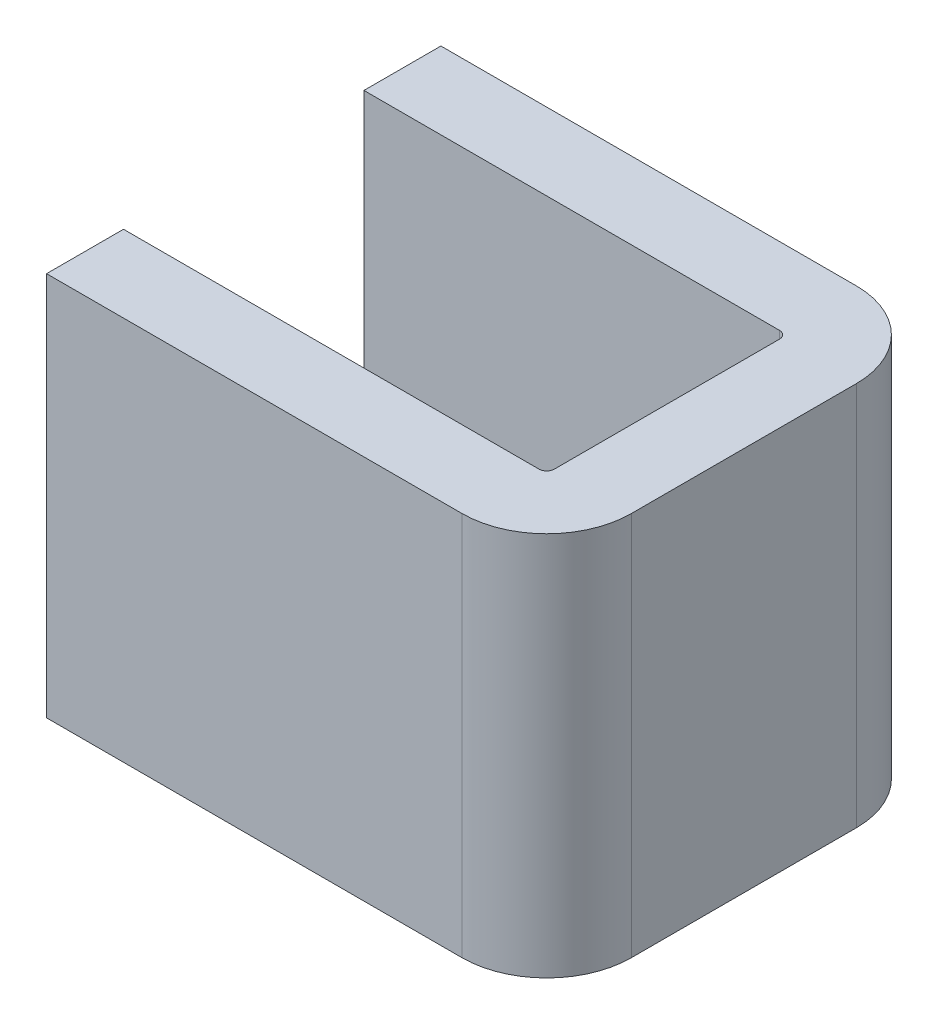
ISO-10303-21;
HEADER;
FILE_DESCRIPTION(('STEP AP214'),'2;1');
FILE_NAME('part.step','',(''),(''),'','','');
FILE_SCHEMA(('AUTOMOTIVE_DESIGN { 1 0 10303 214 1 1 1 1 }'));
ENDSEC;
DATA;
#1=APPLICATION_CONTEXT('core data for automotive mechanical design processes');
#2=APPLICATION_PROTOCOL_DEFINITION('international standard','automotive_design',2000,#1);
#3=PRODUCT_CONTEXT('',#1,'mechanical');
#4=PRODUCT('Part','Part','',(#3));
#5=PRODUCT_RELATED_PRODUCT_CATEGORY('part','',(#4));
#6=PRODUCT_DEFINITION_FORMATION('','',#4);
#7=PRODUCT_DEFINITION_CONTEXT('part definition',#1,'design');
#8=PRODUCT_DEFINITION('design','',#6,#7);
#9=PRODUCT_DEFINITION_SHAPE('','',#8);
#10=(LENGTH_UNIT() NAMED_UNIT(*) SI_UNIT(.MILLI.,.METRE.));
#11=(NAMED_UNIT(*) PLANE_ANGLE_UNIT() SI_UNIT($,.RADIAN.));
#12=(NAMED_UNIT(*) SI_UNIT($,.STERADIAN.) SOLID_ANGLE_UNIT());
#13=UNCERTAINTY_MEASURE_WITH_UNIT(LENGTH_MEASURE(1.E-05),#10,'distance_accuracy_value','');
#14=(GEOMETRIC_REPRESENTATION_CONTEXT(3) GLOBAL_UNCERTAINTY_ASSIGNED_CONTEXT((#13)) GLOBAL_UNIT_ASSIGNED_CONTEXT((#10,
#11,#12)) REPRESENTATION_CONTEXT('',''));
#15=CARTESIAN_POINT('',(0.,0.,0.));
#16=DIRECTION('',(0.,0.,1.));
#17=DIRECTION('',(1.,0.,0.));
#18=AXIS2_PLACEMENT_3D('',#15,#16,#17);
#19=CARTESIAN_POINT('',(1.08,0.5,0.));
#20=DIRECTION('',(0.,0.,1.));
#21=DIRECTION('',(1.,0.,0.));
#22=AXIS2_PLACEMENT_3D('',#19,#20,#21);
#23=PLANE('',#22);
#24=DIRECTION('',(0.,1.,0.));
#25=VECTOR('',#24,1.);
#26=CARTESIAN_POINT('',(0.,-0.5,0.));
#27=LINE('',#26,#25);
#28=CARTESIAN_POINT('',(0.,-0.5,0.));
#29=VERTEX_POINT('',#28);
#30=CARTESIAN_POINT('',(0.,0.5,0.));
#31=VERTEX_POINT('',#30);
#32=EDGE_CURVE('E96',#29,#31,#27,.T.);
#33=ORIENTED_EDGE('',*,*,#32,.T.);
#34=DIRECTION('',(1.,0.,0.));
#35=VECTOR('',#34,1.);
#36=CARTESIAN_POINT('',(1.08,0.5,0.));
#37=LINE('',#36,#35);
#38=CARTESIAN_POINT('',(1.08,0.5,0.));
#39=VERTEX_POINT('',#38);
#40=EDGE_CURVE('E187',#31,#39,#37,.T.);
#41=ORIENTED_EDGE('',*,*,#40,.T.);
#42=DIRECTION('',(0.,1.,0.));
#43=VECTOR('',#42,1.);
#44=CARTESIAN_POINT('',(1.08,0.5,0.));
#45=LINE('',#44,#43);
#46=CARTESIAN_POINT('',(1.08,-0.5,0.));
#47=VERTEX_POINT('',#46);
#48=EDGE_CURVE('E189',#47,#39,#45,.T.);
#49=ORIENTED_EDGE('',*,*,#48,.F.);
#50=DIRECTION('',(1.,0.,0.));
#51=VECTOR('',#50,1.);
#52=CARTESIAN_POINT('',(1.08,-0.5,0.));
#53=LINE('',#52,#51);
#54=EDGE_CURVE('E86',#47,#29,#53,.F.);
#55=ORIENTED_EDGE('',*,*,#54,.T.);
#56=EDGE_LOOP('',(#33,#41,#49,#55));
#57=FACE_BOUND('',#56,.T.);
#58=ADVANCED_FACE('F16',(#57),#23,.F.);
#59=CARTESIAN_POINT('',(0.,-0.5,0.2));
#60=DIRECTION('',(1.,0.,0.));
#61=DIRECTION('',(0.,0.,-1.));
#62=AXIS2_PLACEMENT_3D('',#59,#60,#61);
#63=PLANE('',#62);
#64=DIRECTION('',(0.,0.,-1.));
#65=VECTOR('',#64,1.);
#66=CARTESIAN_POINT('',(0.,0.5,0.2));
#67=LINE('',#66,#65);
#68=CARTESIAN_POINT('',(0.,0.5,0.2));
#69=VERTEX_POINT('',#68);
#70=EDGE_CURVE('E183',#69,#31,#67,.T.);
#71=ORIENTED_EDGE('',*,*,#70,.T.);
#72=ORIENTED_EDGE('',*,*,#32,.F.);
#73=DIRECTION('',(0.,0.,-1.));
#74=VECTOR('',#73,1.);
#75=CARTESIAN_POINT('',(0.,-0.5,0.2));
#76=LINE('',#75,#74);
#77=CARTESIAN_POINT('',(0.,-0.5,0.2));
#78=VERTEX_POINT('',#77);
#79=EDGE_CURVE('E191',#78,#29,#76,.T.);
#80=ORIENTED_EDGE('',*,*,#79,.F.);
#81=DIRECTION('',(0.,1.,0.));
#82=VECTOR('',#81,1.);
#83=CARTESIAN_POINT('',(0.,-0.5,0.2));
#84=LINE('',#83,#82);
#85=EDGE_CURVE('E185',#78,#69,#84,.T.);
#86=ORIENTED_EDGE('',*,*,#85,.T.);
#87=EDGE_LOOP('',(#71,#72,#80,#86));
#88=FACE_BOUND('',#87,.T.);
#89=ADVANCED_FACE('F174',(#88),#63,.F.);
#90=CARTESIAN_POINT('',(1.08,0.5,0.22));
#91=DIRECTION('',(0.,1.,0.));
#92=DIRECTION('',(0.,0.,1.));
#93=AXIS2_PLACEMENT_3D('',#90,#91,#92);
#94=CYLINDRICAL_SURFACE('',#93,0.22);
#95=CARTESIAN_POINT('',(1.08,0.5,0.22));
#96=DIRECTION('',(0.,1.,0.));
#97=DIRECTION('',(0.,0.,1.));
#98=AXIS2_PLACEMENT_3D('',#95,#96,#97);
#99=CIRCLE('',#98,0.22);
#100=CARTESIAN_POINT('',(1.3,0.5,0.22));
#101=VERTEX_POINT('',#100);
#102=EDGE_CURVE('E232',#101,#39,#99,.T.);
#103=ORIENTED_EDGE('',*,*,#102,.F.);
#104=DIRECTION('',(0.,1.,0.));
#105=VECTOR('',#104,1.);
#106=CARTESIAN_POINT('',(1.3,0.5,0.22));
#107=LINE('',#106,#105);
#108=CARTESIAN_POINT('',(1.3,-0.5,0.22));
#109=VERTEX_POINT('',#108);
#110=EDGE_CURVE('E234',#101,#109,#107,.F.);
#111=ORIENTED_EDGE('',*,*,#110,.T.);
#112=CARTESIAN_POINT('',(1.08,-0.5,0.22));
#113=DIRECTION('',(0.,1.,0.));
#114=DIRECTION('',(0.,0.,1.));
#115=AXIS2_PLACEMENT_3D('',#112,#113,#114);
#116=CIRCLE('',#115,0.22);
#117=EDGE_CURVE('E19',#47,#109,#116,.F.);
#118=ORIENTED_EDGE('',*,*,#117,.F.);
#119=ORIENTED_EDGE('',*,*,#48,.T.);
#120=EDGE_LOOP('',(#103,#111,#118,#119));
#121=FACE_BOUND('',#120,.T.);
#122=ADVANCED_FACE('F171',(#121),#94,.T.);
#123=CARTESIAN_POINT('',(1.08,-0.5,0.2));
#124=DIRECTION('',(0.,0.,-1.));
#125=DIRECTION('',(-1.,0.,0.));
#126=AXIS2_PLACEMENT_3D('',#123,#124,#125);
#127=PLANE('',#126);
#128=ORIENTED_EDGE('',*,*,#85,.F.);
#129=DIRECTION('',(-1.,0.,0.));
#130=VECTOR('',#129,1.);
#131=CARTESIAN_POINT('',(1.08,-0.5,0.2));
#132=LINE('',#131,#130);
#133=CARTESIAN_POINT('',(1.08,-0.5,0.2));
#134=VERTEX_POINT('',#133);
#135=EDGE_CURVE('E200',#134,#78,#132,.T.);
#136=ORIENTED_EDGE('',*,*,#135,.F.);
#137=DIRECTION('',(0.,1.,0.));
#138=VECTOR('',#137,1.);
#139=CARTESIAN_POINT('',(1.08,-0.5,0.2));
#140=LINE('',#139,#138);
#141=CARTESIAN_POINT('',(1.08,0.5,0.2));
#142=VERTEX_POINT('',#141);
#143=EDGE_CURVE('E228',#134,#142,#140,.T.);
#144=ORIENTED_EDGE('',*,*,#143,.T.);
#145=DIRECTION('',(-1.,0.,0.));
#146=VECTOR('',#145,1.);
#147=CARTESIAN_POINT('',(1.08,0.5,0.2));
#148=LINE('',#147,#146);
#149=EDGE_CURVE('E199',#69,#142,#148,.F.);
#150=ORIENTED_EDGE('',*,*,#149,.F.);
#151=EDGE_LOOP('',(#128,#136,#144,#150));
#152=FACE_BOUND('',#151,.T.);
#153=ADVANCED_FACE('F167',(#152),#127,.F.);
#154=CARTESIAN_POINT('',(1.3,0.5,0.805));
#155=DIRECTION('',(-1.,0.,0.));
#156=DIRECTION('',(0.,0.,1.));
#157=AXIS2_PLACEMENT_3D('',#154,#155,#156);
#158=PLANE('',#157);
#159=ORIENTED_EDGE('',*,*,#110,.F.);
#160=DIRECTION('',(0.,0.,-1.));
#161=VECTOR('',#160,1.);
#162=CARTESIAN_POINT('',(1.3,0.5,0.805));
#163=LINE('',#162,#161);
#164=CARTESIAN_POINT('',(1.3,0.5,0.805));
#165=VERTEX_POINT('',#164);
#166=EDGE_CURVE('E227',#101,#165,#163,.F.);
#167=ORIENTED_EDGE('',*,*,#166,.T.);
#168=DIRECTION('',(0.,1.,0.));
#169=VECTOR('',#168,1.);
#170=CARTESIAN_POINT('',(1.3,0.5,0.805));
#171=LINE('',#170,#169);
#172=CARTESIAN_POINT('',(1.3,-0.5,0.805));
#173=VERTEX_POINT('',#172);
#174=EDGE_CURVE('E224',#173,#165,#171,.T.);
#175=ORIENTED_EDGE('',*,*,#174,.F.);
#176=DIRECTION('',(0.,0.,1.));
#177=VECTOR('',#176,1.);
#178=CARTESIAN_POINT('',(1.3,-0.5,0.805));
#179=LINE('',#178,#177);
#180=EDGE_CURVE('E231',#173,#109,#179,.F.);
#181=ORIENTED_EDGE('',*,*,#180,.T.);
#182=EDGE_LOOP('',(#159,#167,#175,#181));
#183=FACE_BOUND('',#182,.T.);
#184=ADVANCED_FACE('F163',(#183),#158,.F.);
#185=CARTESIAN_POINT('',(1.08,-0.5,0.22));
#186=DIRECTION('',(0.,1.,0.));
#187=DIRECTION('',(0.,0.,1.));
#188=AXIS2_PLACEMENT_3D('',#185,#186,#187);
#189=CYLINDRICAL_SURFACE('',#188,0.02);
#190=ORIENTED_EDGE('',*,*,#143,.F.);
#191=CARTESIAN_POINT('',(1.08,-0.5,0.22));
#192=DIRECTION('',(0.,1.,0.));
#193=DIRECTION('',(0.,0.,1.));
#194=AXIS2_PLACEMENT_3D('',#191,#192,#193);
#195=CIRCLE('',#194,0.02);
#196=CARTESIAN_POINT('',(1.1,-0.5,0.22));
#197=VERTEX_POINT('',#196);
#198=EDGE_CURVE('E229',#197,#134,#195,.T.);
#199=ORIENTED_EDGE('',*,*,#198,.F.);
#200=DIRECTION('',(0.,1.,0.));
#201=VECTOR('',#200,1.);
#202=CARTESIAN_POINT('',(1.1,-0.5,0.22));
#203=LINE('',#202,#201);
#204=CARTESIAN_POINT('',(1.1,0.5,0.22));
#205=VERTEX_POINT('',#204);
#206=EDGE_CURVE('E256',#197,#205,#203,.T.);
#207=ORIENTED_EDGE('',*,*,#206,.T.);
#208=CARTESIAN_POINT('',(1.08,0.5,0.22));
#209=DIRECTION('',(0.,1.,0.));
#210=DIRECTION('',(0.,0.,1.));
#211=AXIS2_PLACEMENT_3D('',#208,#209,#210);
#212=CIRCLE('',#211,0.02);
#213=EDGE_CURVE('E225',#142,#205,#212,.F.);
#214=ORIENTED_EDGE('',*,*,#213,.F.);
#215=EDGE_LOOP('',(#190,#199,#207,#214));
#216=FACE_BOUND('',#215,.T.);
#217=ADVANCED_FACE('F159',(#216),#189,.F.);
#218=CARTESIAN_POINT('',(1.08,0.5,0.805));
#219=DIRECTION('',(0.,1.,0.));
#220=DIRECTION('',(0.,0.,1.));
#221=AXIS2_PLACEMENT_3D('',#218,#219,#220);
#222=CYLINDRICAL_SURFACE('',#221,0.22);
#223=CARTESIAN_POINT('',(1.08,0.5,0.805));
#224=DIRECTION('',(0.,1.,0.));
#225=DIRECTION('',(0.,0.,1.));
#226=AXIS2_PLACEMENT_3D('',#223,#224,#225);
#227=CIRCLE('',#226,0.22);
#228=CARTESIAN_POINT('',(1.08,0.5,1.025));
#229=VERTEX_POINT('',#228);
#230=EDGE_CURVE('E217',#229,#165,#227,.T.);
#231=ORIENTED_EDGE('',*,*,#230,.F.);
#232=DIRECTION('',(0.,1.,0.));
#233=VECTOR('',#232,1.);
#234=CARTESIAN_POINT('',(1.08,0.5,1.025));
#235=LINE('',#234,#233);
#236=CARTESIAN_POINT('',(1.08,-0.5,1.025));
#237=VERTEX_POINT('',#236);
#238=EDGE_CURVE('E219',#229,#237,#235,.F.);
#239=ORIENTED_EDGE('',*,*,#238,.T.);
#240=CARTESIAN_POINT('',(1.08,-0.5,0.805));
#241=DIRECTION('',(0.,1.,0.));
#242=DIRECTION('',(0.,0.,1.));
#243=AXIS2_PLACEMENT_3D('',#240,#241,#242);
#244=CIRCLE('',#243,0.22);
#245=EDGE_CURVE('E221',#173,#237,#244,.F.);
#246=ORIENTED_EDGE('',*,*,#245,.F.);
#247=ORIENTED_EDGE('',*,*,#174,.T.);
#248=EDGE_LOOP('',(#231,#239,#246,#247));
#249=FACE_BOUND('',#248,.T.);
#250=ADVANCED_FACE('F155',(#249),#222,.T.);
#251=CARTESIAN_POINT('',(1.1,-0.5,0.805));
#252=DIRECTION('',(1.,0.,0.));
#253=DIRECTION('',(0.,0.,-1.));
#254=AXIS2_PLACEMENT_3D('',#251,#252,#253);
#255=PLANE('',#254);
#256=ORIENTED_EDGE('',*,*,#206,.F.);
#257=DIRECTION('',(0.,0.,-1.));
#258=VECTOR('',#257,1.);
#259=CARTESIAN_POINT('',(1.1,-0.5,0.805));
#260=LINE('',#259,#258);
#261=CARTESIAN_POINT('',(1.1,-0.5,0.805));
#262=VERTEX_POINT('',#261);
#263=EDGE_CURVE('E223',#262,#197,#260,.T.);
#264=ORIENTED_EDGE('',*,*,#263,.F.);
#265=DIRECTION('',(0.,1.,0.));
#266=VECTOR('',#265,1.);
#267=CARTESIAN_POINT('',(1.1,-0.5,0.805));
#268=LINE('',#267,#266);
#269=CARTESIAN_POINT('',(1.1,0.5,0.805));
#270=VERTEX_POINT('',#269);
#271=EDGE_CURVE('E212',#262,#270,#268,.T.);
#272=ORIENTED_EDGE('',*,*,#271,.T.);
#273=DIRECTION('',(0.,0.,-1.));
#274=VECTOR('',#273,1.);
#275=CARTESIAN_POINT('',(1.1,0.5,0.805));
#276=LINE('',#275,#274);
#277=EDGE_CURVE('E220',#205,#270,#276,.F.);
#278=ORIENTED_EDGE('',*,*,#277,.F.);
#279=EDGE_LOOP('',(#256,#264,#272,#278));
#280=FACE_BOUND('',#279,.T.);
#281=ADVANCED_FACE('F151',(#280),#255,.F.);
#282=CARTESIAN_POINT('',(0.,0.5,1.025));
#283=DIRECTION('',(0.,0.,-1.));
#284=DIRECTION('',(-1.,0.,0.));
#285=AXIS2_PLACEMENT_3D('',#282,#283,#284);
#286=PLANE('',#285);
#287=ORIENTED_EDGE('',*,*,#238,.F.);
#288=DIRECTION('',(1.,0.,0.));
#289=VECTOR('',#288,1.);
#290=CARTESIAN_POINT('',(0.,0.5,1.025));
#291=LINE('',#290,#289);
#292=CARTESIAN_POINT('',(0.,0.5,1.025));
#293=VERTEX_POINT('',#292);
#294=EDGE_CURVE('E120',#229,#293,#291,.F.);
#295=ORIENTED_EDGE('',*,*,#294,.T.);
#296=DIRECTION('',(0.,1.,0.));
#297=VECTOR('',#296,1.);
#298=CARTESIAN_POINT('',(0.,-0.5,1.025));
#299=LINE('',#298,#297);
#300=CARTESIAN_POINT('',(0.,-0.5,1.025));
#301=VERTEX_POINT('',#300);
#302=EDGE_CURVE('E125',#301,#293,#299,.T.);
#303=ORIENTED_EDGE('',*,*,#302,.F.);
#304=DIRECTION('',(1.,0.,0.));
#305=VECTOR('',#304,1.);
#306=CARTESIAN_POINT('',(0.,-0.5,1.025));
#307=LINE('',#306,#305);
#308=EDGE_CURVE('E216',#301,#237,#307,.T.);
#309=ORIENTED_EDGE('',*,*,#308,.T.);
#310=EDGE_LOOP('',(#287,#295,#303,#309));
#311=FACE_BOUND('',#310,.T.);
#312=ADVANCED_FACE('F148',(#311),#286,.F.);
#313=CARTESIAN_POINT('',(0.,-0.5,0.825));
#314=DIRECTION('',(-1.,0.,0.));
#315=DIRECTION('',(0.,0.,1.));
#316=AXIS2_PLACEMENT_3D('',#313,#314,#315);
#317=PLANE('',#316);
#318=ORIENTED_EDGE('',*,*,#302,.T.);
#319=DIRECTION('',(0.,0.,-1.));
#320=VECTOR('',#319,1.);
#321=CARTESIAN_POINT('',(0.,0.5,0.825));
#322=LINE('',#321,#320);
#323=CARTESIAN_POINT('',(0.,0.5,0.825));
#324=VERTEX_POINT('',#323);
#325=EDGE_CURVE('E123',#293,#324,#322,.T.);
#326=ORIENTED_EDGE('',*,*,#325,.T.);
#327=DIRECTION('',(0.,1.,0.));
#328=VECTOR('',#327,1.);
#329=CARTESIAN_POINT('',(0.,-0.5,0.825));
#330=LINE('',#329,#328);
#331=CARTESIAN_POINT('',(0.,-0.5,0.825));
#332=VERTEX_POINT('',#331);
#333=EDGE_CURVE('E111',#324,#332,#330,.F.);
#334=ORIENTED_EDGE('',*,*,#333,.T.);
#335=DIRECTION('',(0.,0.,1.));
#336=VECTOR('',#335,1.);
#337=CARTESIAN_POINT('',(0.,-0.5,1.025));
#338=LINE('',#337,#336);
#339=EDGE_CURVE('E268',#332,#301,#338,.T.);
#340=ORIENTED_EDGE('',*,*,#339,.T.);
#341=EDGE_LOOP('',(#318,#326,#334,#340));
#342=FACE_BOUND('',#341,.T.);
#343=ADVANCED_FACE('F124',(#342),#317,.T.);
#344=CARTESIAN_POINT('',(0.,-0.5,1.025));
#345=DIRECTION('',(0.,1.,0.));
#346=DIRECTION('',(0.,0.,1.));
#347=AXIS2_PLACEMENT_3D('',#344,#345,#346);
#348=PLANE('',#347);
#349=DIRECTION('',(1.,0.,0.));
#350=VECTOR('',#349,1.);
#351=CARTESIAN_POINT('',(0.,-0.5,0.825));
#352=LINE('',#351,#350);
#353=CARTESIAN_POINT('',(1.08,-0.5,0.825));
#354=VERTEX_POINT('',#353);
#355=EDGE_CURVE('E117',#332,#354,#352,.T.);
#356=ORIENTED_EDGE('',*,*,#355,.T.);
#357=CARTESIAN_POINT('',(1.08,-0.5,0.805));
#358=DIRECTION('',(0.,1.,0.));
#359=DIRECTION('',(0.,0.,1.));
#360=AXIS2_PLACEMENT_3D('',#357,#358,#359);
#361=CIRCLE('',#360,0.02);
#362=EDGE_CURVE('E213',#354,#262,#361,.T.);
#363=ORIENTED_EDGE('',*,*,#362,.T.);
#364=ORIENTED_EDGE('',*,*,#263,.T.);
#365=ORIENTED_EDGE('',*,*,#198,.T.);
#366=ORIENTED_EDGE('',*,*,#135,.T.);
#367=ORIENTED_EDGE('',*,*,#79,.T.);
#368=ORIENTED_EDGE('',*,*,#54,.F.);
#369=ORIENTED_EDGE('',*,*,#117,.T.);
#370=ORIENTED_EDGE('',*,*,#180,.F.);
#371=ORIENTED_EDGE('',*,*,#245,.T.);
#372=ORIENTED_EDGE('',*,*,#308,.F.);
#373=ORIENTED_EDGE('',*,*,#339,.F.);
#374=EDGE_LOOP('',(#356,#363,#364,#365,#366,#367,#368,#369,#370,#371,#372,#373));
#375=FACE_BOUND('',#374,.T.);
#376=ADVANCED_FACE('F140',(#375),#348,.F.);
#377=CARTESIAN_POINT('',(1.08,-0.5,0.805));
#378=DIRECTION('',(0.,1.,0.));
#379=DIRECTION('',(0.,0.,1.));
#380=AXIS2_PLACEMENT_3D('',#377,#378,#379);
#381=CYLINDRICAL_SURFACE('',#380,0.02);
#382=ORIENTED_EDGE('',*,*,#271,.F.);
#383=ORIENTED_EDGE('',*,*,#362,.F.);
#384=DIRECTION('',(0.,1.,0.));
#385=VECTOR('',#384,1.);
#386=CARTESIAN_POINT('',(1.08,-0.5,0.825));
#387=LINE('',#386,#385);
#388=CARTESIAN_POINT('',(1.08,0.5,0.825));
#389=VERTEX_POINT('',#388);
#390=EDGE_CURVE('E25',#354,#389,#387,.T.);
#391=ORIENTED_EDGE('',*,*,#390,.T.);
#392=CARTESIAN_POINT('',(1.08,0.5,0.805));
#393=DIRECTION('',(0.,1.,0.));
#394=DIRECTION('',(0.,0.,1.));
#395=AXIS2_PLACEMENT_3D('',#392,#393,#394);
#396=CIRCLE('',#395,0.02);
#397=EDGE_CURVE('E33',#270,#389,#396,.F.);
#398=ORIENTED_EDGE('',*,*,#397,.F.);
#399=EDGE_LOOP('',(#382,#383,#391,#398));
#400=FACE_BOUND('',#399,.T.);
#401=ADVANCED_FACE('F132',(#400),#381,.F.);
#402=CARTESIAN_POINT('',(0.,0.5,0.825));
#403=DIRECTION('',(0.,-1.,0.));
#404=DIRECTION('',(0.,0.,-1.));
#405=AXIS2_PLACEMENT_3D('',#402,#403,#404);
#406=PLANE('',#405);
#407=ORIENTED_EDGE('',*,*,#294,.F.);
#408=ORIENTED_EDGE('',*,*,#230,.T.);
#409=ORIENTED_EDGE('',*,*,#166,.F.);
#410=ORIENTED_EDGE('',*,*,#102,.T.);
#411=ORIENTED_EDGE('',*,*,#40,.F.);
#412=ORIENTED_EDGE('',*,*,#70,.F.);
#413=ORIENTED_EDGE('',*,*,#149,.T.);
#414=ORIENTED_EDGE('',*,*,#213,.T.);
#415=ORIENTED_EDGE('',*,*,#277,.T.);
#416=ORIENTED_EDGE('',*,*,#397,.T.);
#417=DIRECTION('',(1.,0.,0.));
#418=VECTOR('',#417,1.);
#419=CARTESIAN_POINT('',(0.,0.5,0.825));
#420=LINE('',#419,#418);
#421=EDGE_CURVE('E11',#389,#324,#420,.F.);
#422=ORIENTED_EDGE('',*,*,#421,.T.);
#423=ORIENTED_EDGE('',*,*,#325,.F.);
#424=EDGE_LOOP('',(#407,#408,#409,#410,#411,#412,#413,#414,#415,#416,#422,#423));
#425=FACE_BOUND('',#424,.T.);
#426=ADVANCED_FACE('F129',(#425),#406,.F.);
#427=CARTESIAN_POINT('',(0.,-0.5,0.825));
#428=DIRECTION('',(0.,0.,1.));
#429=DIRECTION('',(1.,0.,0.));
#430=AXIS2_PLACEMENT_3D('',#427,#428,#429);
#431=PLANE('',#430);
#432=ORIENTED_EDGE('',*,*,#390,.F.);
#433=ORIENTED_EDGE('',*,*,#355,.F.);
#434=ORIENTED_EDGE('',*,*,#333,.F.);
#435=ORIENTED_EDGE('',*,*,#421,.F.);
#436=EDGE_LOOP('',(#432,#433,#434,#435));
#437=FACE_BOUND('',#436,.T.);
#438=ADVANCED_FACE('F114',(#437),#431,.F.);
#439=CLOSED_SHELL('',(#58,#89,#122,#153,#184,#217,#250,#281,#312,#343,#376,#401,#426,#438));
#440=MANIFOLD_SOLID_BREP('B1',#439);
#441=ADVANCED_BREP_SHAPE_REPRESENTATION('',(#18,#440),#14);
#442=SHAPE_DEFINITION_REPRESENTATION(#9,#441);
ENDSEC;
END-ISO-10303-21;
